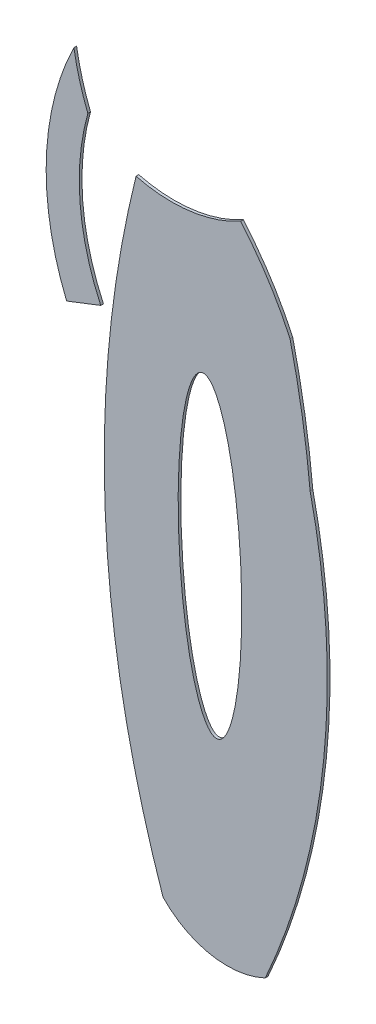
ISO-10303-21;
HEADER;
FILE_DESCRIPTION(('STEP AP214'),'2;1');
FILE_NAME('part.step','',(''),(''),'','','');
FILE_SCHEMA(('AUTOMOTIVE_DESIGN { 1 0 10303 214 1 1 1 1 }'));
ENDSEC;
DATA;
#1=APPLICATION_CONTEXT('core data for automotive mechanical design processes');
#2=APPLICATION_PROTOCOL_DEFINITION('international standard','automotive_design',2000,#1);
#3=PRODUCT_CONTEXT('',#1,'mechanical');
#4=PRODUCT('Part','Part','',(#3));
#5=PRODUCT_RELATED_PRODUCT_CATEGORY('part','',(#4));
#6=PRODUCT_DEFINITION_FORMATION('','',#4);
#7=PRODUCT_DEFINITION_CONTEXT('part definition',#1,'design');
#8=PRODUCT_DEFINITION('design','',#6,#7);
#9=PRODUCT_DEFINITION_SHAPE('','',#8);
#10=(LENGTH_UNIT() NAMED_UNIT(*) SI_UNIT(.MILLI.,.METRE.));
#11=(NAMED_UNIT(*) PLANE_ANGLE_UNIT() SI_UNIT($,.RADIAN.));
#12=(NAMED_UNIT(*) SI_UNIT($,.STERADIAN.) SOLID_ANGLE_UNIT());
#13=UNCERTAINTY_MEASURE_WITH_UNIT(LENGTH_MEASURE(1.E-05),#10,'distance_accuracy_value','');
#14=(GEOMETRIC_REPRESENTATION_CONTEXT(3) GLOBAL_UNCERTAINTY_ASSIGNED_CONTEXT((#13)) GLOBAL_UNIT_ASSIGNED_CONTEXT((#10,
#11,#12)) REPRESENTATION_CONTEXT('',''));
#15=CARTESIAN_POINT('',(0.,0.,0.));
#16=DIRECTION('',(0.,0.,1.));
#17=DIRECTION('',(1.,0.,0.));
#18=AXIS2_PLACEMENT_3D('',#15,#16,#17);
#19=CARTESIAN_POINT('',(2.86707418693472,-37.1506637889885,0.1));
#20=DIRECTION('',(0.,0.,1.));
#21=DIRECTION('',(1.,0.,0.));
#22=AXIS2_PLACEMENT_3D('',#19,#20,#21);
#23=PLANE('',#22);
#24=CARTESIAN_POINT('',(14.1393020046934,-41.0410924409991,0.1));
#25=DIRECTION('',(0.,0.,1.));
#26=DIRECTION('',(1.,0.,0.));
#27=AXIS2_PLACEMENT_3D('',#24,#25,#26);
#28=CIRCLE('',#27,3.30242613608448);
#29=CARTESIAN_POINT('',(11.7527715409,-43.3237423768587,0.1));
#30=VERTEX_POINT('',#29);
#31=CARTESIAN_POINT('',(15.5540182303388,-44.0251494755059,0.1));
#32=VERTEX_POINT('',#31);
#33=EDGE_CURVE('E139',#30,#32,#28,.T.);
#34=ORIENTED_EDGE('',*,*,#33,.T.);
#35=CARTESIAN_POINT('',(-8.40515363082399,-33.2602351369779,0.1));
#36=DIRECTION('',(0.,0.,1.));
#37=DIRECTION('',(1.,0.,0.));
#38=AXIS2_PLACEMENT_3D('',#35,#36,#37);
#39=CIRCLE('',#38,26.2664290871177);
#40=CARTESIAN_POINT('',(17.2224471122607,-27.5025118767277,0.1));
#41=VERTEX_POINT('',#40);
#42=EDGE_CURVE('E97',#32,#41,#39,.T.);
#43=ORIENTED_EDGE('',*,*,#42,.T.);
#44=CARTESIAN_POINT('',(-15.6543576473457,-30.5948301397284,0.1));
#45=DIRECTION('',(0.,0.,1.));
#46=DIRECTION('',(1.,0.,0.));
#47=AXIS2_PLACEMENT_3D('',#44,#45,#46);
#48=CIRCLE('',#47,33.021912776836);
#49=CARTESIAN_POINT('',(16.4751942883537,-22.9699618882656,0.1));
#50=VERTEX_POINT('',#49);
#51=EDGE_CURVE('E110',#41,#50,#48,.T.);
#52=ORIENTED_EDGE('',*,*,#51,.T.);
#53=CARTESIAN_POINT('',(5.33074613495261,-28.1052239810274,0.1));
#54=DIRECTION('',(0.,0.,1.));
#55=DIRECTION('',(1.,0.,0.));
#56=AXIS2_PLACEMENT_3D('',#53,#54,#55);
#57=CIRCLE('',#56,12.2706821898866);
#58=CARTESIAN_POINT('',(14.6357200734836,-20.1060301836213,0.1));
#59=VERTEX_POINT('',#58);
#60=EDGE_CURVE('E104',#50,#59,#57,.T.);
#61=ORIENTED_EDGE('',*,*,#60,.T.);
#62=CARTESIAN_POINT('',(12.0677118741467,-15.4332639071866,0.1));
#63=DIRECTION('',(0.,0.,-1.));
#64=DIRECTION('',(1.,0.,0.));
#65=AXIS2_PLACEMENT_3D('',#62,#63,#64);
#66=CIRCLE('',#65,5.33192374158214);
#67=CARTESIAN_POINT('',(10.7484541625187,-20.5994007497758,0.1));
#68=VERTEX_POINT('',#67);
#69=EDGE_CURVE('E108',#59,#68,#66,.T.);
#70=ORIENTED_EDGE('',*,*,#69,.T.);
#71=CARTESIAN_POINT('',(49.6220187176871,-30.265721783529,0.1));
#72=DIRECTION('',(0.,0.,1.));
#73=DIRECTION('',(1.,0.,0.));
#74=AXIS2_PLACEMENT_3D('',#71,#72,#73);
#75=CIRCLE('',#74,40.0573561727733);
#76=EDGE_CURVE('E60',#68,#30,#75,.T.);
#77=ORIENTED_EDGE('',*,*,#76,.T.);
#78=EDGE_LOOP('',(#34,#43,#52,#61,#70,#77));
#79=FACE_BOUND('',#78,.T.);
#80=CARTESIAN_POINT('',(13.4971773947769,-31.454583950872,0.1));
#81=DIRECTION('',(0.,0.,1.));
#82=DIRECTION('',(-0.0433436041167678,0.999060224401997,0.));
#83=AXIS2_PLACEMENT_3D('',#80,#81,#82);
#84=ELLIPSE('',#83,5.76745587523709,1.15748963810723);
#85=CARTESIAN_POINT('',(13.2471950705597,-25.6925481899291,0.1));
#86=VERTEX_POINT('',#85);
#87=EDGE_CURVE('E132',#86,#86,#84,.T.);
#88=ORIENTED_EDGE('',*,*,#87,.F.);
#89=EDGE_LOOP('',(#88));
#90=FACE_BOUND('',#89,.T.);
#91=ADVANCED_FACE('F43',(#79,#90),#23,.T.);
#92=CARTESIAN_POINT('',(2.86707418693472,-37.1506637889885,0.));
#93=DIRECTION('',(0.,0.,1.));
#94=DIRECTION('',(1.,0.,0.));
#95=AXIS2_PLACEMENT_3D('',#92,#93,#94);
#96=PLANE('',#95);
#97=CARTESIAN_POINT('',(14.1393020046934,-41.0410924409991,0.));
#98=DIRECTION('',(0.,0.,1.));
#99=DIRECTION('',(1.,0.,0.));
#100=AXIS2_PLACEMENT_3D('',#97,#98,#99);
#101=CIRCLE('',#100,3.30242613608448);
#102=CARTESIAN_POINT('',(11.7527715409,-43.3237423768587,0.));
#103=VERTEX_POINT('',#102);
#104=CARTESIAN_POINT('',(15.5540182303388,-44.0251494755059,0.));
#105=VERTEX_POINT('',#104);
#106=EDGE_CURVE('E128',#103,#105,#101,.T.);
#107=ORIENTED_EDGE('',*,*,#106,.F.);
#108=CARTESIAN_POINT('',(49.6220187176871,-30.265721783529,0.));
#109=DIRECTION('',(0.,0.,1.));
#110=DIRECTION('',(1.,0.,0.));
#111=AXIS2_PLACEMENT_3D('',#108,#109,#110);
#112=CIRCLE('',#111,40.0573561727733);
#113=CARTESIAN_POINT('',(10.7484541625187,-20.5994007497758,0.));
#114=VERTEX_POINT('',#113);
#115=EDGE_CURVE('E89',#114,#103,#112,.T.);
#116=ORIENTED_EDGE('',*,*,#115,.F.);
#117=CARTESIAN_POINT('',(12.0677118741467,-15.4332639071866,0.));
#118=DIRECTION('',(0.,0.,-1.));
#119=DIRECTION('',(1.,0.,0.));
#120=AXIS2_PLACEMENT_3D('',#117,#118,#119);
#121=CIRCLE('',#120,5.33192374158214);
#122=CARTESIAN_POINT('',(14.6357200734836,-20.1060301836213,0.));
#123=VERTEX_POINT('',#122);
#124=EDGE_CURVE('E83',#123,#114,#121,.T.);
#125=ORIENTED_EDGE('',*,*,#124,.F.);
#126=CARTESIAN_POINT('',(5.33074613495261,-28.1052239810274,0.));
#127=DIRECTION('',(0.,0.,1.));
#128=DIRECTION('',(1.,0.,0.));
#129=AXIS2_PLACEMENT_3D('',#126,#127,#128);
#130=CIRCLE('',#129,12.2706821898866);
#131=CARTESIAN_POINT('',(16.4751942883537,-22.9699618882656,0.));
#132=VERTEX_POINT('',#131);
#133=EDGE_CURVE('E118',#132,#123,#130,.T.);
#134=ORIENTED_EDGE('',*,*,#133,.F.);
#135=CARTESIAN_POINT('',(-15.6543576473457,-30.5948301397284,0.));
#136=DIRECTION('',(0.,0.,1.));
#137=DIRECTION('',(1.,0.,0.));
#138=AXIS2_PLACEMENT_3D('',#135,#136,#137);
#139=CIRCLE('',#138,33.021912776836);
#140=CARTESIAN_POINT('',(17.2224471122607,-27.5025118767277,0.));
#141=VERTEX_POINT('',#140);
#142=EDGE_CURVE('E134',#141,#132,#139,.T.);
#143=ORIENTED_EDGE('',*,*,#142,.F.);
#144=CARTESIAN_POINT('',(-8.40515363082399,-33.2602351369779,0.));
#145=DIRECTION('',(0.,0.,1.));
#146=DIRECTION('',(1.,0.,0.));
#147=AXIS2_PLACEMENT_3D('',#144,#145,#146);
#148=CIRCLE('',#147,26.2664290871177);
#149=EDGE_CURVE('E131',#105,#141,#148,.T.);
#150=ORIENTED_EDGE('',*,*,#149,.F.);
#151=EDGE_LOOP('',(#107,#116,#125,#134,#143,#150));
#152=FACE_BOUND('',#151,.T.);
#153=CARTESIAN_POINT('',(13.4971773947769,-31.454583950872,0.));
#154=DIRECTION('',(0.,0.,1.));
#155=DIRECTION('',(-0.0433436041167678,0.999060224401997,0.));
#156=AXIS2_PLACEMENT_3D('',#153,#154,#155);
#157=ELLIPSE('',#156,5.76745587523709,1.15748963810723);
#158=CARTESIAN_POINT('',(13.2471950705597,-25.6925481899291,0.));
#159=VERTEX_POINT('',#158);
#160=EDGE_CURVE('E174',#159,#159,#157,.T.);
#161=ORIENTED_EDGE('',*,*,#160,.T.);
#162=EDGE_LOOP('',(#161));
#163=FACE_BOUND('',#162,.T.);
#164=ADVANCED_FACE('F148',(#152,#163),#96,.F.);
#165=CARTESIAN_POINT('',(14.1393020046934,-41.0410924409991,0.1));
#166=DIRECTION('',(0.,0.,-1.));
#167=DIRECTION('',(-1.,0.,0.));
#168=AXIS2_PLACEMENT_3D('',#165,#166,#167);
#169=CYLINDRICAL_SURFACE('',#168,3.30242613608448);
#170=ORIENTED_EDGE('',*,*,#106,.T.);
#171=DIRECTION('',(0.,0.,-1.));
#172=VECTOR('',#171,1.);
#173=CARTESIAN_POINT('',(15.5540182303388,-44.0251494755059,0.1));
#174=LINE('',#173,#172);
#175=EDGE_CURVE('E12',#32,#105,#174,.T.);
#176=ORIENTED_EDGE('',*,*,#175,.F.);
#177=ORIENTED_EDGE('',*,*,#33,.F.);
#178=DIRECTION('',(0.,0.,-1.));
#179=VECTOR('',#178,1.);
#180=CARTESIAN_POINT('',(11.7527715409,-43.3237423768587,0.1));
#181=LINE('',#180,#179);
#182=EDGE_CURVE('E124',#30,#103,#181,.T.);
#183=ORIENTED_EDGE('',*,*,#182,.T.);
#184=EDGE_LOOP('',(#170,#176,#177,#183));
#185=FACE_BOUND('',#184,.T.);
#186=ADVANCED_FACE('F45',(#185),#169,.T.);
#187=CARTESIAN_POINT('',(-8.40515363082399,-33.2602351369779,0.1));
#188=DIRECTION('',(0.,0.,-1.));
#189=DIRECTION('',(-1.,0.,0.));
#190=AXIS2_PLACEMENT_3D('',#187,#188,#189);
#191=CYLINDRICAL_SURFACE('',#190,26.2664290871177);
#192=ORIENTED_EDGE('',*,*,#149,.T.);
#193=DIRECTION('',(0.,0.,-1.));
#194=VECTOR('',#193,1.);
#195=CARTESIAN_POINT('',(17.2224471122607,-27.5025118767277,0.1));
#196=LINE('',#195,#194);
#197=EDGE_CURVE('E52',#41,#141,#196,.T.);
#198=ORIENTED_EDGE('',*,*,#197,.F.);
#199=ORIENTED_EDGE('',*,*,#42,.F.);
#200=ORIENTED_EDGE('',*,*,#175,.T.);
#201=EDGE_LOOP('',(#192,#198,#199,#200));
#202=FACE_BOUND('',#201,.T.);
#203=ADVANCED_FACE('F184',(#202),#191,.T.);
#204=CARTESIAN_POINT('',(-15.6543576473457,-30.5948301397284,0.1));
#205=DIRECTION('',(0.,0.,-1.));
#206=DIRECTION('',(-1.,0.,0.));
#207=AXIS2_PLACEMENT_3D('',#204,#205,#206);
#208=CYLINDRICAL_SURFACE('',#207,33.021912776836);
#209=ORIENTED_EDGE('',*,*,#142,.T.);
#210=DIRECTION('',(0.,0.,-1.));
#211=VECTOR('',#210,1.);
#212=CARTESIAN_POINT('',(16.4751942883537,-22.9699618882656,0.1));
#213=LINE('',#212,#211);
#214=EDGE_CURVE('E119',#50,#132,#213,.T.);
#215=ORIENTED_EDGE('',*,*,#214,.F.);
#216=ORIENTED_EDGE('',*,*,#51,.F.);
#217=ORIENTED_EDGE('',*,*,#197,.T.);
#218=EDGE_LOOP('',(#209,#215,#216,#217));
#219=FACE_BOUND('',#218,.T.);
#220=ADVANCED_FACE('F145',(#219),#208,.T.);
#221=CARTESIAN_POINT('',(5.33074613495261,-28.1052239810274,0.1));
#222=DIRECTION('',(0.,0.,-1.));
#223=DIRECTION('',(-1.,0.,0.));
#224=AXIS2_PLACEMENT_3D('',#221,#222,#223);
#225=CYLINDRICAL_SURFACE('',#224,12.2706821898866);
#226=ORIENTED_EDGE('',*,*,#133,.T.);
#227=DIRECTION('',(0.,0.,-1.));
#228=VECTOR('',#227,1.);
#229=CARTESIAN_POINT('',(14.6357200734836,-20.1060301836213,0.1));
#230=LINE('',#229,#228);
#231=EDGE_CURVE('E115',#59,#123,#230,.T.);
#232=ORIENTED_EDGE('',*,*,#231,.F.);
#233=ORIENTED_EDGE('',*,*,#60,.F.);
#234=ORIENTED_EDGE('',*,*,#214,.T.);
#235=EDGE_LOOP('',(#226,#232,#233,#234));
#236=FACE_BOUND('',#235,.T.);
#237=ADVANCED_FACE('F116',(#236),#225,.T.);
#238=CARTESIAN_POINT('',(12.0677118741467,-15.4332639071866,0.1));
#239=DIRECTION('',(0.,0.,-1.));
#240=DIRECTION('',(-1.,0.,0.));
#241=AXIS2_PLACEMENT_3D('',#238,#239,#240);
#242=CYLINDRICAL_SURFACE('',#241,5.33192374158214);
#243=ORIENTED_EDGE('',*,*,#124,.T.);
#244=DIRECTION('',(0.,0.,-1.));
#245=VECTOR('',#244,1.);
#246=CARTESIAN_POINT('',(10.7484541625187,-20.5994007497758,0.1));
#247=LINE('',#246,#245);
#248=EDGE_CURVE('E120',#68,#114,#247,.T.);
#249=ORIENTED_EDGE('',*,*,#248,.F.);
#250=ORIENTED_EDGE('',*,*,#69,.F.);
#251=ORIENTED_EDGE('',*,*,#231,.T.);
#252=EDGE_LOOP('',(#243,#249,#250,#251));
#253=FACE_BOUND('',#252,.T.);
#254=ADVANCED_FACE('F122',(#253),#242,.F.);
#255=CARTESIAN_POINT('',(49.6220187176871,-30.265721783529,0.1));
#256=DIRECTION('',(0.,0.,-1.));
#257=DIRECTION('',(-1.,0.,0.));
#258=AXIS2_PLACEMENT_3D('',#255,#256,#257);
#259=CYLINDRICAL_SURFACE('',#258,40.0573561727733);
#260=ORIENTED_EDGE('',*,*,#115,.T.);
#261=ORIENTED_EDGE('',*,*,#182,.F.);
#262=ORIENTED_EDGE('',*,*,#76,.F.);
#263=ORIENTED_EDGE('',*,*,#248,.T.);
#264=EDGE_LOOP('',(#260,#261,#262,#263));
#265=FACE_BOUND('',#264,.T.);
#266=ADVANCED_FACE('F153',(#265),#259,.T.);
#267=DIRECTION('',(0.,0.,-1.));
#268=VECTOR('',#267,1.);
#269=SURFACE_OF_LINEAR_EXTRUSION('',#84,#268);
#270=ORIENTED_EDGE('',*,*,#87,.T.);
#271=EDGE_LOOP('',(#270));
#272=FACE_BOUND('',#271,.T.);
#273=ORIENTED_EDGE('',*,*,#160,.F.);
#274=EDGE_LOOP('',(#273));
#275=FACE_BOUND('',#274,.T.);
#276=ADVANCED_FACE('F155',(#272,#275),#269,.T.);
#277=CLOSED_SHELL('',(#91,#164,#186,#203,#220,#237,#254,#266,#276));
#278=MANIFOLD_SOLID_BREP('B2',#277);
#279=CARTESIAN_POINT('',(17.2835773188201,-16.1495309411357,0.1));
#280=DIRECTION('',(0.,0.,-1.));
#281=DIRECTION('',(-1.,0.,0.));
#282=AXIS2_PLACEMENT_3D('',#279,#280,#281);
#283=CYLINDRICAL_SURFACE('',#282,8.96787207303494);
#284=CARTESIAN_POINT('',(17.2835773188201,-16.1495309411357,0.));
#285=DIRECTION('',(0.,0.,-1.));
#286=DIRECTION('',(1.,0.,0.));
#287=AXIS2_PLACEMENT_3D('',#284,#285,#286);
#288=CIRCLE('',#287,8.96787207303494);
#289=CARTESIAN_POINT('',(8.95400514789501,-19.4723244898941,0.));
#290=VERTEX_POINT('',#289);
#291=CARTESIAN_POINT('',(8.43560146781277,-17.6110550970468,0.));
#292=VERTEX_POINT('',#291);
#293=EDGE_CURVE('E304',#290,#292,#288,.T.);
#294=ORIENTED_EDGE('',*,*,#293,.T.);
#295=DIRECTION('',(0.,0.,-1.));
#296=VECTOR('',#295,1.);
#297=CARTESIAN_POINT('',(8.43560146781277,-17.6110550970468,0.1));
#298=LINE('',#297,#296);
#299=CARTESIAN_POINT('',(8.43560146781277,-17.6110550970468,0.1));
#300=VERTEX_POINT('',#299);
#301=EDGE_CURVE('E41',#300,#292,#298,.T.);
#302=ORIENTED_EDGE('',*,*,#301,.F.);
#303=CARTESIAN_POINT('',(17.2835773188201,-16.1495309411357,0.1));
#304=DIRECTION('',(0.,0.,-1.));
#305=DIRECTION('',(1.,0.,0.));
#306=AXIS2_PLACEMENT_3D('',#303,#304,#305);
#307=CIRCLE('',#306,8.96787207303494);
#308=CARTESIAN_POINT('',(8.95400514789501,-19.4723244898941,0.1));
#309=VERTEX_POINT('',#308);
#310=EDGE_CURVE('E292',#309,#300,#307,.T.);
#311=ORIENTED_EDGE('',*,*,#310,.F.);
#312=DIRECTION('',(0.,0.,-1.));
#313=VECTOR('',#312,1.);
#314=CARTESIAN_POINT('',(8.95400514789501,-19.4723244898941,0.1));
#315=LINE('',#314,#313);
#316=EDGE_CURVE('E300',#309,#290,#315,.T.);
#317=ORIENTED_EDGE('',*,*,#316,.T.);
#318=EDGE_LOOP('',(#294,#302,#311,#317));
#319=FACE_BOUND('',#318,.T.);
#320=ADVANCED_FACE('F241',(#319),#283,.F.);
#321=CARTESIAN_POINT('',(17.5289732477092,-22.0630496151501,0.1));
#322=DIRECTION('',(0.,0.,-1.));
#323=DIRECTION('',(-1.,0.,0.));
#324=AXIS2_PLACEMENT_3D('',#321,#322,#323);
#325=CYLINDRICAL_SURFACE('',#324,10.1247057002482);
#326=CARTESIAN_POINT('',(17.5289732477092,-22.0630496151501,0.));
#327=DIRECTION('',(0.,0.,1.));
#328=DIRECTION('',(1.,0.,0.));
#329=AXIS2_PLACEMENT_3D('',#326,#327,#328);
#330=CIRCLE('',#329,10.1247057002482);
#331=CARTESIAN_POINT('',(8.16446066443115,-25.9121494572256,0.));
#332=VERTEX_POINT('',#331);
#333=EDGE_CURVE('E296',#292,#332,#330,.T.);
#334=ORIENTED_EDGE('',*,*,#333,.T.);
#335=DIRECTION('',(0.,0.,-1.));
#336=VECTOR('',#335,1.);
#337=CARTESIAN_POINT('',(8.16446066443115,-25.9121494572256,0.1));
#338=LINE('',#337,#336);
#339=CARTESIAN_POINT('',(8.16446066443115,-25.9121494572256,0.1));
#340=VERTEX_POINT('',#339);
#341=EDGE_CURVE('E249',#340,#332,#338,.T.);
#342=ORIENTED_EDGE('',*,*,#341,.F.);
#343=CARTESIAN_POINT('',(17.5289732477092,-22.0630496151501,0.1));
#344=DIRECTION('',(0.,0.,1.));
#345=DIRECTION('',(1.,0.,0.));
#346=AXIS2_PLACEMENT_3D('',#343,#344,#345);
#347=CIRCLE('',#346,10.1247057002482);
#348=EDGE_CURVE('E287',#300,#340,#347,.T.);
#349=ORIENTED_EDGE('',*,*,#348,.F.);
#350=ORIENTED_EDGE('',*,*,#301,.T.);
#351=EDGE_LOOP('',(#334,#342,#349,#350));
#352=FACE_BOUND('',#351,.T.);
#353=ADVANCED_FACE('F295',(#352),#325,.T.);
#354=CARTESIAN_POINT('',(8.16446066443115,-25.9121494572256,0.1));
#355=DIRECTION('',(-0.362236146011651,0.932086355721735,0.));
#356=DIRECTION('',(-0.932086355721736,-0.362236146011651,0.));
#357=AXIS2_PLACEMENT_3D('',#354,#355,#356);
#358=PLANE('',#357);
#359=DIRECTION('',(0.932086355721736,0.362236146011651,0.));
#360=VECTOR('',#359,1.);
#361=CARTESIAN_POINT('',(8.16446066443115,-25.9121494572256,0.));
#362=LINE('',#361,#360);
#363=CARTESIAN_POINT('',(9.43446324828181,-25.4185891357223,0.));
#364=VERTEX_POINT('',#363);
#365=EDGE_CURVE('E274',#332,#364,#362,.T.);
#366=ORIENTED_EDGE('',*,*,#365,.T.);
#367=DIRECTION('',(0.,0.,-1.));
#368=VECTOR('',#367,1.);
#369=CARTESIAN_POINT('',(9.43446324828181,-25.4185891357223,0.1));
#370=LINE('',#369,#368);
#371=CARTESIAN_POINT('',(9.43446324828181,-25.4185891357223,0.1));
#372=VERTEX_POINT('',#371);
#373=EDGE_CURVE('E297',#372,#364,#370,.T.);
#374=ORIENTED_EDGE('',*,*,#373,.F.);
#375=DIRECTION('',(0.932086355721736,0.362236146011651,0.));
#376=VECTOR('',#375,1.);
#377=CARTESIAN_POINT('',(8.16446066443115,-25.9121494572256,0.1));
#378=LINE('',#377,#376);
#379=EDGE_CURVE('E290',#340,#372,#378,.T.);
#380=ORIENTED_EDGE('',*,*,#379,.F.);
#381=ORIENTED_EDGE('',*,*,#341,.T.);
#382=EDGE_LOOP('',(#366,#374,#380,#381));
#383=FACE_BOUND('',#382,.T.);
#384=ADVANCED_FACE('F298',(#383),#358,.F.);
#385=CARTESIAN_POINT('',(17.2599320166195,-21.7937485416494,0.1));
#386=DIRECTION('',(0.,0.,-1.));
#387=DIRECTION('',(-1.,0.,0.));
#388=AXIS2_PLACEMENT_3D('',#385,#386,#387);
#389=CYLINDRICAL_SURFACE('',#388,8.62423508356927);
#390=CARTESIAN_POINT('',(17.2599320166195,-21.7937485416494,0.));
#391=DIRECTION('',(0.,0.,-1.));
#392=DIRECTION('',(1.,0.,0.));
#393=AXIS2_PLACEMENT_3D('',#390,#391,#392);
#394=CIRCLE('',#393,8.62423508356927);
#395=EDGE_CURVE('E280',#364,#290,#394,.T.);
#396=ORIENTED_EDGE('',*,*,#395,.T.);
#397=ORIENTED_EDGE('',*,*,#316,.F.);
#398=CARTESIAN_POINT('',(17.2599320166195,-21.7937485416494,0.1));
#399=DIRECTION('',(0.,0.,-1.));
#400=DIRECTION('',(1.,0.,0.));
#401=AXIS2_PLACEMENT_3D('',#398,#399,#400);
#402=CIRCLE('',#401,8.62423508356927);
#403=EDGE_CURVE('E257',#372,#309,#402,.T.);
#404=ORIENTED_EDGE('',*,*,#403,.F.);
#405=ORIENTED_EDGE('',*,*,#373,.T.);
#406=EDGE_LOOP('',(#396,#397,#404,#405));
#407=FACE_BOUND('',#406,.T.);
#408=ADVANCED_FACE('F311',(#407),#389,.F.);
#409=CARTESIAN_POINT('',(17.2835773188201,-16.1495309411357,0.1));
#410=DIRECTION('',(0.,0.,1.));
#411=DIRECTION('',(1.,0.,0.));
#412=AXIS2_PLACEMENT_3D('',#409,#410,#411);
#413=PLANE('',#412);
#414=ORIENTED_EDGE('',*,*,#310,.T.);
#415=ORIENTED_EDGE('',*,*,#348,.T.);
#416=ORIENTED_EDGE('',*,*,#379,.T.);
#417=ORIENTED_EDGE('',*,*,#403,.T.);
#418=EDGE_LOOP('',(#414,#415,#416,#417));
#419=FACE_BOUND('',#418,.T.);
#420=ADVANCED_FACE('F288',(#419),#413,.T.);
#421=CARTESIAN_POINT('',(17.2835773188201,-16.1495309411357,0.));
#422=DIRECTION('',(0.,0.,1.));
#423=DIRECTION('',(1.,0.,0.));
#424=AXIS2_PLACEMENT_3D('',#421,#422,#423);
#425=PLANE('',#424);
#426=ORIENTED_EDGE('',*,*,#293,.F.);
#427=ORIENTED_EDGE('',*,*,#395,.F.);
#428=ORIENTED_EDGE('',*,*,#365,.F.);
#429=ORIENTED_EDGE('',*,*,#333,.F.);
#430=EDGE_LOOP('',(#426,#427,#428,#429));
#431=FACE_BOUND('',#430,.T.);
#432=ADVANCED_FACE('F314',(#431),#425,.F.);
#433=CLOSED_SHELL('',(#320,#353,#384,#408,#420,#432));
#434=MANIFOLD_SOLID_BREP('B6',#433);
#435=ADVANCED_BREP_SHAPE_REPRESENTATION('',(#18,#278,#434),#14);
#436=SHAPE_DEFINITION_REPRESENTATION(#9,#435);
ENDSEC;
END-ISO-10303-21;
